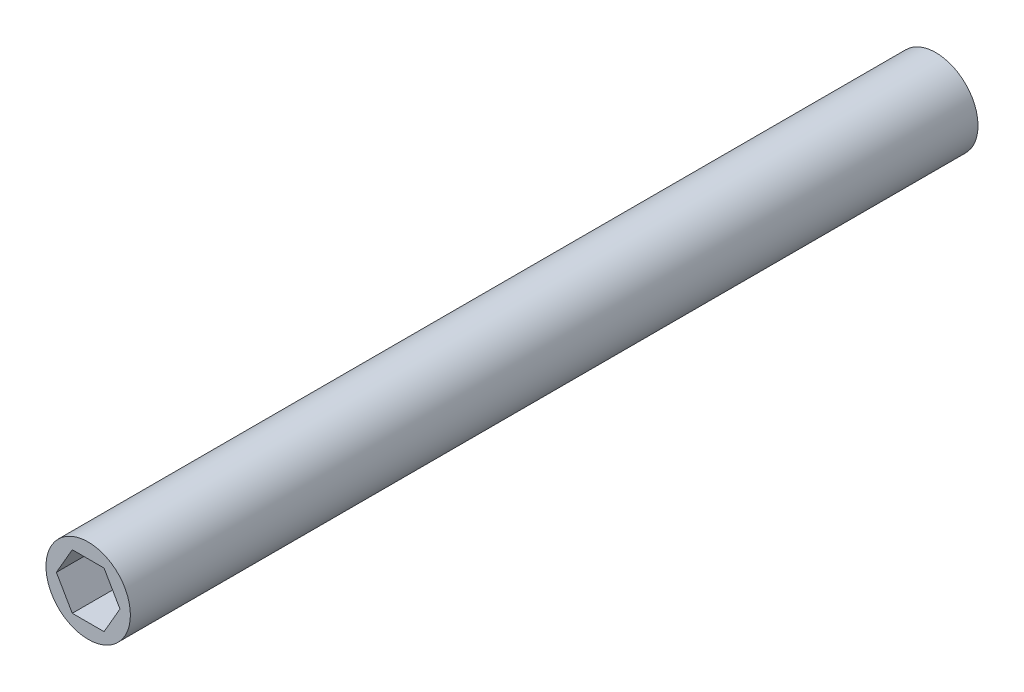
ISO-10303-21;
HEADER;
FILE_DESCRIPTION(('STEP AP214'),'2;1');
FILE_NAME('part.step','',(''),(''),'','','');
FILE_SCHEMA(('AUTOMOTIVE_DESIGN { 1 0 10303 214 1 1 1 1 }'));
ENDSEC;
DATA;
#1=APPLICATION_CONTEXT('core data for automotive mechanical design processes');
#2=APPLICATION_PROTOCOL_DEFINITION('international standard','automotive_design',2000,#1);
#3=PRODUCT_CONTEXT('',#1,'mechanical');
#4=PRODUCT('Part','Part','',(#3));
#5=PRODUCT_RELATED_PRODUCT_CATEGORY('part','',(#4));
#6=PRODUCT_DEFINITION_FORMATION('','',#4);
#7=PRODUCT_DEFINITION_CONTEXT('part definition',#1,'design');
#8=PRODUCT_DEFINITION('design','',#6,#7);
#9=PRODUCT_DEFINITION_SHAPE('','',#8);
#10=(LENGTH_UNIT() NAMED_UNIT(*) SI_UNIT(.MILLI.,.METRE.));
#11=(NAMED_UNIT(*) PLANE_ANGLE_UNIT() SI_UNIT($,.RADIAN.));
#12=(NAMED_UNIT(*) SI_UNIT($,.STERADIAN.) SOLID_ANGLE_UNIT());
#13=UNCERTAINTY_MEASURE_WITH_UNIT(LENGTH_MEASURE(1.E-05),#10,'distance_accuracy_value','');
#14=(GEOMETRIC_REPRESENTATION_CONTEXT(3) GLOBAL_UNCERTAINTY_ASSIGNED_CONTEXT((#13)) GLOBAL_UNIT_ASSIGNED_CONTEXT((#10,
#11,#12)) REPRESENTATION_CONTEXT('',''));
#15=CARTESIAN_POINT('',(0.,0.,0.));
#16=DIRECTION('',(0.,0.,1.));
#17=DIRECTION('',(1.,0.,0.));
#18=AXIS2_PLACEMENT_3D('',#15,#16,#17);
#19=CARTESIAN_POINT('',(0.,0.,127.));
#20=DIRECTION('',(0.,0.,-1.));
#21=DIRECTION('',(-1.,0.,0.));
#22=AXIS2_PLACEMENT_3D('',#19,#20,#21);
#23=CYLINDRICAL_SURFACE('',#22,6.3246);
#24=CARTESIAN_POINT('',(0.,0.,127.));
#25=DIRECTION('',(0.,0.,1.));
#26=DIRECTION('',(1.,0.,0.));
#27=AXIS2_PLACEMENT_3D('',#24,#25,#26);
#28=CIRCLE('',#27,6.3246);
#29=CARTESIAN_POINT('',(6.3246,0.,127.));
#30=VERTEX_POINT('',#29);
#31=EDGE_CURVE('E237',#30,#30,#28,.T.);
#32=ORIENTED_EDGE('',*,*,#31,.F.);
#33=EDGE_LOOP('',(#32));
#34=FACE_BOUND('',#33,.T.);
#35=DIRECTION('',(0.,0.,-1.));
#36=VECTOR('',#35,1.);
#37=CARTESIAN_POINT('',(1.5875,-6.12212454218305,127.));
#38=LINE('',#37,#36);
#39=CARTESIAN_POINT('',(1.5875,-6.12212454218305,0.));
#40=VERTEX_POINT('',#39);
#41=CARTESIAN_POINT('',(1.5875,-6.12212454218305,21.336));
#42=VERTEX_POINT('',#41);
#43=EDGE_CURVE('E233',#40,#42,#38,.F.);
#44=ORIENTED_EDGE('',*,*,#43,.F.);
#45=CARTESIAN_POINT('',(0.,0.,0.));
#46=DIRECTION('',(0.,0.,1.));
#47=DIRECTION('',(1.,0.,0.));
#48=AXIS2_PLACEMENT_3D('',#45,#46,#47);
#49=CIRCLE('',#48,6.3246);
#50=CARTESIAN_POINT('',(-1.5875,-6.12212454218305,0.));
#51=VERTEX_POINT('',#50);
#52=EDGE_CURVE('E236',#40,#51,#49,.T.);
#53=ORIENTED_EDGE('',*,*,#52,.T.);
#54=DIRECTION('',(0.,0.,-1.));
#55=VECTOR('',#54,1.);
#56=CARTESIAN_POINT('',(-1.5875,-6.12212454218305,0.));
#57=LINE('',#56,#55);
#58=CARTESIAN_POINT('',(-1.5875,-6.12212454218305,21.336));
#59=VERTEX_POINT('',#58);
#60=EDGE_CURVE('E198',#59,#51,#57,.T.);
#61=ORIENTED_EDGE('',*,*,#60,.F.);
#62=DIRECTION('',(0.,0.,-1.));
#63=VECTOR('',#62,1.);
#64=CARTESIAN_POINT('',(-1.5875,-6.12212454218305,127.));
#65=LINE('',#64,#63);
#66=CARTESIAN_POINT('',(-1.5875,-6.12212454218305,49.911));
#67=VERTEX_POINT('',#66);
#68=EDGE_CURVE('E228',#67,#59,#65,.T.);
#69=ORIENTED_EDGE('',*,*,#68,.F.);
#70=CARTESIAN_POINT('',(0.,0.,49.911));
#71=DIRECTION('',(0.,0.,1.));
#72=DIRECTION('',(1.,0.,0.));
#73=AXIS2_PLACEMENT_3D('',#70,#71,#72);
#74=CIRCLE('',#73,6.3246);
#75=CARTESIAN_POINT('',(1.5875,-6.12212454218305,49.911));
#76=VERTEX_POINT('',#75);
#77=EDGE_CURVE('E47',#67,#76,#74,.T.);
#78=ORIENTED_EDGE('',*,*,#77,.T.);
#79=EDGE_CURVE('E232',#42,#76,#38,.F.);
#80=ORIENTED_EDGE('',*,*,#79,.F.);
#81=EDGE_LOOP('',(#44,#53,#61,#69,#78,#80));
#82=FACE_BOUND('',#81,.T.);
#83=ADVANCED_FACE('F39',(#34,#82),#23,.T.);
#84=CARTESIAN_POINT('',(0.,0.,127.));
#85=DIRECTION('',(0.,0.,1.));
#86=DIRECTION('',(1.,0.,0.));
#87=AXIS2_PLACEMENT_3D('',#84,#85,#86);
#88=PLANE('',#87);
#89=DIRECTION('',(0.499999999999999,0.866025403784439,0.));
#90=VECTOR('',#89,1.);
#91=CARTESIAN_POINT('',(2.38125,-4.12444598552339,127.));
#92=LINE('',#91,#90);
#93=CARTESIAN_POINT('',(2.38125,-4.12444598552339,127.));
#94=VERTEX_POINT('',#93);
#95=CARTESIAN_POINT('',(4.7625,0.,127.));
#96=VERTEX_POINT('',#95);
#97=EDGE_CURVE('E54',#94,#96,#92,.T.);
#98=ORIENTED_EDGE('',*,*,#97,.F.);
#99=DIRECTION('',(1.,0.,0.));
#100=VECTOR('',#99,1.);
#101=CARTESIAN_POINT('',(-2.38125,-4.12444598552339,127.));
#102=LINE('',#101,#100);
#103=CARTESIAN_POINT('',(-2.38125,-4.12444598552339,127.));
#104=VERTEX_POINT('',#103);
#105=EDGE_CURVE('E146',#104,#94,#102,.T.);
#106=ORIENTED_EDGE('',*,*,#105,.F.);
#107=DIRECTION('',(0.5,-0.866025403784439,0.));
#108=VECTOR('',#107,1.);
#109=CARTESIAN_POINT('',(-4.7625,0.,127.));
#110=LINE('',#109,#108);
#111=CARTESIAN_POINT('',(-4.7625,0.,127.));
#112=VERTEX_POINT('',#111);
#113=EDGE_CURVE('E150',#112,#104,#110,.T.);
#114=ORIENTED_EDGE('',*,*,#113,.F.);
#115=DIRECTION('',(-0.5,-0.866025403784439,0.));
#116=VECTOR('',#115,1.);
#117=CARTESIAN_POINT('',(-2.38125,4.12444598552339,127.));
#118=LINE('',#117,#116);
#119=CARTESIAN_POINT('',(-2.38125,4.12444598552339,127.));
#120=VERTEX_POINT('',#119);
#121=EDGE_CURVE('E173',#120,#112,#118,.T.);
#122=ORIENTED_EDGE('',*,*,#121,.F.);
#123=DIRECTION('',(-1.,0.,0.));
#124=VECTOR('',#123,1.);
#125=CARTESIAN_POINT('',(2.38125,4.12444598552339,127.));
#126=LINE('',#125,#124);
#127=CARTESIAN_POINT('',(2.38125,4.12444598552339,127.));
#128=VERTEX_POINT('',#127);
#129=EDGE_CURVE('E169',#128,#120,#126,.T.);
#130=ORIENTED_EDGE('',*,*,#129,.F.);
#131=DIRECTION('',(-0.5,0.866025403784439,0.));
#132=VECTOR('',#131,1.);
#133=CARTESIAN_POINT('',(4.7625,0.,127.));
#134=LINE('',#133,#132);
#135=EDGE_CURVE('E166',#96,#128,#134,.T.);
#136=ORIENTED_EDGE('',*,*,#135,.F.);
#137=EDGE_LOOP('',(#98,#106,#114,#122,#130,#136));
#138=FACE_BOUND('',#137,.T.);
#139=ORIENTED_EDGE('',*,*,#31,.T.);
#140=EDGE_LOOP('',(#139));
#141=FACE_BOUND('',#140,.T.);
#142=ADVANCED_FACE('F276',(#138,#141),#88,.T.);
#143=CARTESIAN_POINT('',(0.,0.,0.));
#144=DIRECTION('',(0.,0.,1.));
#145=DIRECTION('',(1.,0.,0.));
#146=AXIS2_PLACEMENT_3D('',#143,#144,#145);
#147=PLANE('',#146);
#148=ORIENTED_EDGE('',*,*,#52,.F.);
#149=DIRECTION('',(-1.,0.,0.));
#150=VECTOR('',#149,1.);
#151=CARTESIAN_POINT('',(2.34949999999994,-6.12212454218305,0.));
#152=LINE('',#151,#150);
#153=EDGE_CURVE('E202',#40,#51,#152,.T.);
#154=ORIENTED_EDGE('',*,*,#153,.T.);
#155=EDGE_LOOP('',(#148,#154));
#156=FACE_BOUND('',#155,.T.);
#157=ADVANCED_FACE('F273',(#156),#147,.F.);
#158=CARTESIAN_POINT('',(1.5875,-5.5245,49.911));
#159=DIRECTION('',(-1.,0.,0.));
#160=DIRECTION('',(0.,-1.,0.));
#161=AXIS2_PLACEMENT_3D('',#158,#159,#160);
#162=PLANE('',#161);
#163=DIRECTION('',(0.,0.,-1.));
#164=VECTOR('',#163,1.);
#165=CARTESIAN_POINT('',(1.5875,-7.1247,49.911));
#166=LINE('',#165,#164);
#167=CARTESIAN_POINT('',(1.5875,-7.1247,49.911));
#168=VERTEX_POINT('',#167);
#169=CARTESIAN_POINT('',(1.5875,-7.1247,21.336));
#170=VERTEX_POINT('',#169);
#171=EDGE_CURVE('E220',#168,#170,#166,.T.);
#172=ORIENTED_EDGE('',*,*,#171,.T.);
#173=DIRECTION('',(0.,1.,0.));
#174=VECTOR('',#173,1.);
#175=CARTESIAN_POINT('',(1.5875,-5.5245,21.336));
#176=LINE('',#175,#174);
#177=EDGE_CURVE('E62',#170,#42,#176,.T.);
#178=ORIENTED_EDGE('',*,*,#177,.T.);
#179=ORIENTED_EDGE('',*,*,#79,.T.);
#180=DIRECTION('',(0.,1.,0.));
#181=VECTOR('',#180,1.);
#182=CARTESIAN_POINT('',(1.5875,-5.5245,49.911));
#183=LINE('',#182,#181);
#184=EDGE_CURVE('E210',#168,#76,#183,.T.);
#185=ORIENTED_EDGE('',*,*,#184,.F.);
#186=EDGE_LOOP('',(#172,#178,#179,#185));
#187=FACE_BOUND('',#186,.T.);
#188=ADVANCED_FACE('F257',(#187),#162,.F.);
#189=CARTESIAN_POINT('',(-1.5875,-5.5245,49.911));
#190=DIRECTION('',(1.,0.,0.));
#191=DIRECTION('',(0.,1.,0.));
#192=AXIS2_PLACEMENT_3D('',#189,#190,#191);
#193=PLANE('',#192);
#194=ORIENTED_EDGE('',*,*,#68,.T.);
#195=DIRECTION('',(0.,1.,0.));
#196=VECTOR('',#195,1.);
#197=CARTESIAN_POINT('',(-1.5875,-6.12212454218305,21.336));
#198=LINE('',#197,#196);
#199=CARTESIAN_POINT('',(-1.5875,-7.1247,21.336));
#200=VERTEX_POINT('',#199);
#201=EDGE_CURVE('E183',#200,#59,#198,.T.);
#202=ORIENTED_EDGE('',*,*,#201,.F.);
#203=DIRECTION('',(0.,0.,-1.));
#204=VECTOR('',#203,1.);
#205=CARTESIAN_POINT('',(-1.5875,-7.1247,49.911));
#206=LINE('',#205,#204);
#207=CARTESIAN_POINT('',(-1.5875,-7.1247,49.911));
#208=VERTEX_POINT('',#207);
#209=EDGE_CURVE('E224',#208,#200,#206,.T.);
#210=ORIENTED_EDGE('',*,*,#209,.F.);
#211=DIRECTION('',(0.,-1.,0.));
#212=VECTOR('',#211,1.);
#213=CARTESIAN_POINT('',(-1.5875,-5.5245,49.911));
#214=LINE('',#213,#212);
#215=EDGE_CURVE('E214',#67,#208,#214,.T.);
#216=ORIENTED_EDGE('',*,*,#215,.F.);
#217=EDGE_LOOP('',(#194,#202,#210,#216));
#218=FACE_BOUND('',#217,.T.);
#219=ADVANCED_FACE('F265',(#218),#193,.F.);
#220=CARTESIAN_POINT('',(-1.5875,-7.1247,49.911));
#221=DIRECTION('',(0.,1.,0.));
#222=DIRECTION('',(0.,0.,1.));
#223=AXIS2_PLACEMENT_3D('',#220,#221,#222);
#224=PLANE('',#223);
#225=ORIENTED_EDGE('',*,*,#209,.T.);
#226=DIRECTION('',(1.,0.,0.));
#227=VECTOR('',#226,1.);
#228=CARTESIAN_POINT('',(-1.5875,-7.1247,21.336));
#229=LINE('',#228,#227);
#230=EDGE_CURVE('E11',#200,#170,#229,.T.);
#231=ORIENTED_EDGE('',*,*,#230,.T.);
#232=ORIENTED_EDGE('',*,*,#171,.F.);
#233=DIRECTION('',(1.,0.,0.));
#234=VECTOR('',#233,1.);
#235=CARTESIAN_POINT('',(-1.5875,-7.1247,49.911));
#236=LINE('',#235,#234);
#237=EDGE_CURVE('E217',#208,#168,#236,.T.);
#238=ORIENTED_EDGE('',*,*,#237,.F.);
#239=EDGE_LOOP('',(#225,#231,#232,#238));
#240=FACE_BOUND('',#239,.T.);
#241=ADVANCED_FACE('F260',(#240),#224,.F.);
#242=CARTESIAN_POINT('',(0.,0.,49.911));
#243=DIRECTION('',(0.,0.,1.));
#244=DIRECTION('',(1.,0.,0.));
#245=AXIS2_PLACEMENT_3D('',#242,#243,#244);
#246=PLANE('',#245);
#247=ORIENTED_EDGE('',*,*,#77,.F.);
#248=ORIENTED_EDGE('',*,*,#215,.T.);
#249=ORIENTED_EDGE('',*,*,#237,.T.);
#250=ORIENTED_EDGE('',*,*,#184,.T.);
#251=EDGE_LOOP('',(#247,#248,#249,#250));
#252=FACE_BOUND('',#251,.T.);
#253=ADVANCED_FACE('F253',(#252),#246,.T.);
#254=CARTESIAN_POINT('',(2.34949999999994,-6.12212454218305,0.));
#255=DIRECTION('',(0.,1.,0.));
#256=DIRECTION('',(-1.,0.,0.));
#257=AXIS2_PLACEMENT_3D('',#254,#255,#256);
#258=PLANE('',#257);
#259=DIRECTION('',(-1.,0.,0.));
#260=VECTOR('',#259,1.);
#261=CARTESIAN_POINT('',(2.34949999999994,-6.12212454218305,21.336));
#262=LINE('',#261,#260);
#263=EDGE_CURVE('E201',#42,#59,#262,.T.);
#264=ORIENTED_EDGE('',*,*,#263,.T.);
#265=ORIENTED_EDGE('',*,*,#60,.T.);
#266=ORIENTED_EDGE('',*,*,#153,.F.);
#267=ORIENTED_EDGE('',*,*,#43,.T.);
#268=EDGE_LOOP('',(#264,#265,#266,#267));
#269=FACE_BOUND('',#268,.T.);
#270=ADVANCED_FACE('F319',(#269),#258,.F.);
#271=CARTESIAN_POINT('',(2.34949999999994,-6.12212454218305,21.336));
#272=DIRECTION('',(0.,0.,1.));
#273=DIRECTION('',(1.,0.,0.));
#274=AXIS2_PLACEMENT_3D('',#271,#272,#273);
#275=PLANE('',#274);
#276=ORIENTED_EDGE('',*,*,#230,.F.);
#277=ORIENTED_EDGE('',*,*,#201,.T.);
#278=ORIENTED_EDGE('',*,*,#263,.F.);
#279=ORIENTED_EDGE('',*,*,#177,.F.);
#280=EDGE_LOOP('',(#276,#277,#278,#279));
#281=FACE_BOUND('',#280,.T.);
#282=ADVANCED_FACE('F263',(#281),#275,.F.);
#283=CARTESIAN_POINT('',(2.38125,-4.12444598552339,118.11));
#284=DIRECTION('',(0.866025403784439,-0.499999999999999,0.));
#285=DIRECTION('',(0.499999999999999,0.866025403784439,0.));
#286=AXIS2_PLACEMENT_3D('',#283,#284,#285);
#287=PLANE('',#286);
#288=ORIENTED_EDGE('',*,*,#97,.T.);
#289=DIRECTION('',(0.,0.,1.));
#290=VECTOR('',#289,1.);
#291=CARTESIAN_POINT('',(4.7625,0.,118.11));
#292=LINE('',#291,#290);
#293=CARTESIAN_POINT('',(4.7625,0.,118.11));
#294=VERTEX_POINT('',#293);
#295=EDGE_CURVE('E120',#294,#96,#292,.T.);
#296=ORIENTED_EDGE('',*,*,#295,.F.);
#297=DIRECTION('',(0.499999999999999,0.866025403784439,0.));
#298=VECTOR('',#297,1.);
#299=CARTESIAN_POINT('',(2.38125,-4.12444598552339,118.11));
#300=LINE('',#299,#298);
#301=CARTESIAN_POINT('',(2.38125,-4.12444598552339,118.11));
#302=VERTEX_POINT('',#301);
#303=EDGE_CURVE('E124',#302,#294,#300,.T.);
#304=ORIENTED_EDGE('',*,*,#303,.F.);
#305=DIRECTION('',(0.,0.,1.));
#306=VECTOR('',#305,1.);
#307=CARTESIAN_POINT('',(2.38125,-4.12444598552339,118.11));
#308=LINE('',#307,#306);
#309=EDGE_CURVE('E180',#302,#94,#308,.T.);
#310=ORIENTED_EDGE('',*,*,#309,.T.);
#311=EDGE_LOOP('',(#288,#296,#304,#310));
#312=FACE_BOUND('',#311,.T.);
#313=ADVANCED_FACE('F122',(#312),#287,.F.);
#314=CARTESIAN_POINT('',(-2.38125,-4.12444598552339,118.11));
#315=DIRECTION('',(0.,-1.,0.));
#316=DIRECTION('',(1.,0.,0.));
#317=AXIS2_PLACEMENT_3D('',#314,#315,#316);
#318=PLANE('',#317);
#319=ORIENTED_EDGE('',*,*,#105,.T.);
#320=ORIENTED_EDGE('',*,*,#309,.F.);
#321=DIRECTION('',(1.,0.,0.));
#322=VECTOR('',#321,1.);
#323=CARTESIAN_POINT('',(-2.38125,-4.12444598552339,118.11));
#324=LINE('',#323,#322);
#325=CARTESIAN_POINT('',(-2.38125,-4.12444598552339,118.11));
#326=VERTEX_POINT('',#325);
#327=EDGE_CURVE('E131',#326,#302,#324,.T.);
#328=ORIENTED_EDGE('',*,*,#327,.F.);
#329=DIRECTION('',(0.,0.,1.));
#330=VECTOR('',#329,1.);
#331=CARTESIAN_POINT('',(-2.38125,-4.12444598552339,118.11));
#332=LINE('',#331,#330);
#333=EDGE_CURVE('E184',#326,#104,#332,.T.);
#334=ORIENTED_EDGE('',*,*,#333,.T.);
#335=EDGE_LOOP('',(#319,#320,#328,#334));
#336=FACE_BOUND('',#335,.T.);
#337=ADVANCED_FACE('F302',(#336),#318,.F.);
#338=CARTESIAN_POINT('',(-4.7625,0.,118.11));
#339=DIRECTION('',(-0.866025403784439,-0.5,0.));
#340=DIRECTION('',(0.5,-0.866025403784439,0.));
#341=AXIS2_PLACEMENT_3D('',#338,#339,#340);
#342=PLANE('',#341);
#343=ORIENTED_EDGE('',*,*,#113,.T.);
#344=ORIENTED_EDGE('',*,*,#333,.F.);
#345=DIRECTION('',(0.5,-0.866025403784439,0.));
#346=VECTOR('',#345,1.);
#347=CARTESIAN_POINT('',(-4.7625,0.,118.11));
#348=LINE('',#347,#346);
#349=CARTESIAN_POINT('',(-4.7625,0.,118.11));
#350=VERTEX_POINT('',#349);
#351=EDGE_CURVE('E159',#350,#326,#348,.T.);
#352=ORIENTED_EDGE('',*,*,#351,.F.);
#353=DIRECTION('',(0.,0.,1.));
#354=VECTOR('',#353,1.);
#355=CARTESIAN_POINT('',(-4.7625,0.,118.11));
#356=LINE('',#355,#354);
#357=EDGE_CURVE('E187',#350,#112,#356,.T.);
#358=ORIENTED_EDGE('',*,*,#357,.T.);
#359=EDGE_LOOP('',(#343,#344,#352,#358));
#360=FACE_BOUND('',#359,.T.);
#361=ADVANCED_FACE('F300',(#360),#342,.F.);
#362=CARTESIAN_POINT('',(-2.38125,4.12444598552339,118.11));
#363=DIRECTION('',(-0.866025403784439,0.5,0.));
#364=DIRECTION('',(-0.5,-0.866025403784439,0.));
#365=AXIS2_PLACEMENT_3D('',#362,#363,#364);
#366=PLANE('',#365);
#367=ORIENTED_EDGE('',*,*,#121,.T.);
#368=ORIENTED_EDGE('',*,*,#357,.F.);
#369=DIRECTION('',(-0.5,-0.866025403784439,0.));
#370=VECTOR('',#369,1.);
#371=CARTESIAN_POINT('',(-2.38125,4.12444598552339,118.11));
#372=LINE('',#371,#370);
#373=CARTESIAN_POINT('',(-2.38125,4.12444598552339,118.11));
#374=VERTEX_POINT('',#373);
#375=EDGE_CURVE('E155',#374,#350,#372,.T.);
#376=ORIENTED_EDGE('',*,*,#375,.F.);
#377=DIRECTION('',(0.,0.,1.));
#378=VECTOR('',#377,1.);
#379=CARTESIAN_POINT('',(-2.38125,4.12444598552339,118.11));
#380=LINE('',#379,#378);
#381=EDGE_CURVE('E190',#374,#120,#380,.T.);
#382=ORIENTED_EDGE('',*,*,#381,.T.);
#383=EDGE_LOOP('',(#367,#368,#376,#382));
#384=FACE_BOUND('',#383,.T.);
#385=ADVANCED_FACE('F298',(#384),#366,.F.);
#386=CARTESIAN_POINT('',(2.38125,4.12444598552339,118.11));
#387=DIRECTION('',(0.,1.,0.));
#388=DIRECTION('',(0.,0.,1.));
#389=AXIS2_PLACEMENT_3D('',#386,#387,#388);
#390=PLANE('',#389);
#391=ORIENTED_EDGE('',*,*,#129,.T.);
#392=ORIENTED_EDGE('',*,*,#381,.F.);
#393=DIRECTION('',(-1.,0.,0.));
#394=VECTOR('',#393,1.);
#395=CARTESIAN_POINT('',(2.38125,4.12444598552339,118.11));
#396=LINE('',#395,#394);
#397=CARTESIAN_POINT('',(2.38125,4.12444598552339,118.11));
#398=VERTEX_POINT('',#397);
#399=EDGE_CURVE('E140',#398,#374,#396,.T.);
#400=ORIENTED_EDGE('',*,*,#399,.F.);
#401=DIRECTION('',(0.,0.,1.));
#402=VECTOR('',#401,1.);
#403=CARTESIAN_POINT('',(2.38125,4.12444598552339,118.11));
#404=LINE('',#403,#402);
#405=EDGE_CURVE('E130',#398,#128,#404,.T.);
#406=ORIENTED_EDGE('',*,*,#405,.T.);
#407=EDGE_LOOP('',(#391,#392,#400,#406));
#408=FACE_BOUND('',#407,.T.);
#409=ADVANCED_FACE('F294',(#408),#390,.F.);
#410=CARTESIAN_POINT('',(4.7625,0.,118.11));
#411=DIRECTION('',(0.866025403784439,0.5,0.));
#412=DIRECTION('',(-0.5,0.866025403784439,0.));
#413=AXIS2_PLACEMENT_3D('',#410,#411,#412);
#414=PLANE('',#413);
#415=ORIENTED_EDGE('',*,*,#135,.T.);
#416=ORIENTED_EDGE('',*,*,#405,.F.);
#417=DIRECTION('',(-0.5,0.866025403784439,0.));
#418=VECTOR('',#417,1.);
#419=CARTESIAN_POINT('',(4.7625,0.,118.11));
#420=LINE('',#419,#418);
#421=EDGE_CURVE('E134',#294,#398,#420,.T.);
#422=ORIENTED_EDGE('',*,*,#421,.F.);
#423=ORIENTED_EDGE('',*,*,#295,.T.);
#424=EDGE_LOOP('',(#415,#416,#422,#423));
#425=FACE_BOUND('',#424,.T.);
#426=ADVANCED_FACE('F135',(#425),#414,.F.);
#427=CARTESIAN_POINT('',(0.,0.,118.11));
#428=DIRECTION('',(0.,0.,1.));
#429=DIRECTION('',(1.,0.,0.));
#430=AXIS2_PLACEMENT_3D('',#427,#428,#429);
#431=PLANE('',#430);
#432=ORIENTED_EDGE('',*,*,#303,.T.);
#433=ORIENTED_EDGE('',*,*,#421,.T.);
#434=ORIENTED_EDGE('',*,*,#399,.T.);
#435=ORIENTED_EDGE('',*,*,#375,.T.);
#436=ORIENTED_EDGE('',*,*,#351,.T.);
#437=ORIENTED_EDGE('',*,*,#327,.T.);
#438=EDGE_LOOP('',(#432,#433,#434,#435,#436,#437));
#439=FACE_BOUND('',#438,.T.);
#440=ADVANCED_FACE('F142',(#439),#431,.T.);
#441=CLOSED_SHELL('',(#83,#142,#157,#188,#219,#241,#253,#270,#282,#313,#337,#361,#385,#409,#426,#440));
#442=MANIFOLD_SOLID_BREP('B2',#441);
#443=ADVANCED_BREP_SHAPE_REPRESENTATION('',(#18,#442),#14);
#444=SHAPE_DEFINITION_REPRESENTATION(#9,#443);
ENDSEC;
END-ISO-10303-21;
